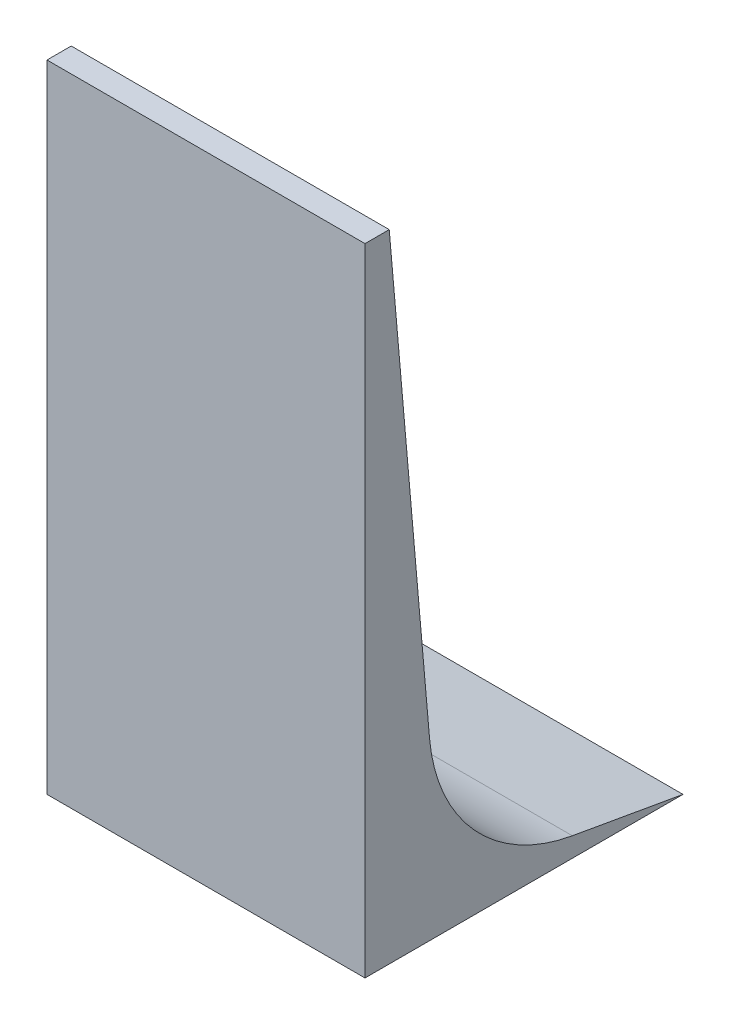
ISO-10303-21;
HEADER;
FILE_DESCRIPTION(('STEP AP214'),'2;1');
FILE_NAME('part.step','',(''),(''),'','','');
FILE_SCHEMA(('AUTOMOTIVE_DESIGN { 1 0 10303 214 1 1 1 1 }'));
ENDSEC;
DATA;
#1=APPLICATION_CONTEXT('core data for automotive mechanical design processes');
#2=APPLICATION_PROTOCOL_DEFINITION('international standard','automotive_design',2000,#1);
#3=PRODUCT_CONTEXT('',#1,'mechanical');
#4=PRODUCT('Part','Part','',(#3));
#5=PRODUCT_RELATED_PRODUCT_CATEGORY('part','',(#4));
#6=PRODUCT_DEFINITION_FORMATION('','',#4);
#7=PRODUCT_DEFINITION_CONTEXT('part definition',#1,'design');
#8=PRODUCT_DEFINITION('design','',#6,#7);
#9=PRODUCT_DEFINITION_SHAPE('','',#8);
#10=(LENGTH_UNIT() NAMED_UNIT(*) SI_UNIT(.MILLI.,.METRE.));
#11=(NAMED_UNIT(*) PLANE_ANGLE_UNIT() SI_UNIT($,.RADIAN.));
#12=(NAMED_UNIT(*) SI_UNIT($,.STERADIAN.) SOLID_ANGLE_UNIT());
#13=UNCERTAINTY_MEASURE_WITH_UNIT(LENGTH_MEASURE(1.E-05),#10,'distance_accuracy_value','');
#14=(GEOMETRIC_REPRESENTATION_CONTEXT(3) GLOBAL_UNCERTAINTY_ASSIGNED_CONTEXT((#13)) GLOBAL_UNIT_ASSIGNED_CONTEXT((#10,
#11,#12)) REPRESENTATION_CONTEXT('',''));
#15=CARTESIAN_POINT('',(0.,0.,0.));
#16=DIRECTION('',(0.,0.,1.));
#17=DIRECTION('',(1.,0.,0.));
#18=AXIS2_PLACEMENT_3D('',#15,#16,#17);
#19=CARTESIAN_POINT('',(-500.,0.,0.));
#20=DIRECTION('',(0.,0.,1.));
#21=DIRECTION('',(1.,0.,0.));
#22=AXIS2_PLACEMENT_3D('',#19,#20,#21);
#23=PLANE('',#22);
#24=DIRECTION('',(0.,-1.,0.));
#25=VECTOR('',#24,1.);
#26=CARTESIAN_POINT('',(0.,0.,0.));
#27=LINE('',#26,#25);
#28=CARTESIAN_POINT('',(0.,1000.,0.));
#29=VERTEX_POINT('',#28);
#30=CARTESIAN_POINT('',(0.,0.,0.));
#31=VERTEX_POINT('',#30);
#32=EDGE_CURVE('E130',#29,#31,#27,.T.);
#33=ORIENTED_EDGE('',*,*,#32,.F.);
#34=DIRECTION('',(1.,0.,0.));
#35=VECTOR('',#34,1.);
#36=CARTESIAN_POINT('',(-500.,1000.,0.));
#37=LINE('',#36,#35);
#38=CARTESIAN_POINT('',(-500.,1000.,0.));
#39=VERTEX_POINT('',#38);
#40=EDGE_CURVE('E11',#39,#29,#37,.T.);
#41=ORIENTED_EDGE('',*,*,#40,.F.);
#42=DIRECTION('',(0.,-1.,0.));
#43=VECTOR('',#42,1.);
#44=CARTESIAN_POINT('',(-500.,0.,0.));
#45=LINE('',#44,#43);
#46=CARTESIAN_POINT('',(-500.,0.,0.));
#47=VERTEX_POINT('',#46);
#48=EDGE_CURVE('E150',#39,#47,#45,.T.);
#49=ORIENTED_EDGE('',*,*,#48,.T.);
#50=DIRECTION('',(1.,0.,0.));
#51=VECTOR('',#50,1.);
#52=CARTESIAN_POINT('',(-500.,0.,0.));
#53=LINE('',#52,#51);
#54=EDGE_CURVE('E42',#47,#31,#53,.T.);
#55=ORIENTED_EDGE('',*,*,#54,.T.);
#56=EDGE_LOOP('',(#33,#41,#49,#55));
#57=FACE_BOUND('',#56,.T.);
#58=ADVANCED_FACE('F39',(#57),#23,.T.);
#59=CARTESIAN_POINT('',(-500.,1000.,0.));
#60=DIRECTION('',(0.,1.,0.));
#61=DIRECTION('',(0.,0.,1.));
#62=AXIS2_PLACEMENT_3D('',#59,#60,#61);
#63=PLANE('',#62);
#64=DIRECTION('',(0.,0.,1.));
#65=VECTOR('',#64,1.);
#66=CARTESIAN_POINT('',(0.,1000.,0.));
#67=LINE('',#66,#65);
#68=CARTESIAN_POINT('',(0.,1000.,-38.1));
#69=VERTEX_POINT('',#68);
#70=EDGE_CURVE('E147',#69,#29,#67,.T.);
#71=ORIENTED_EDGE('',*,*,#70,.F.);
#72=DIRECTION('',(1.,0.,0.));
#73=VECTOR('',#72,1.);
#74=CARTESIAN_POINT('',(-500.,1000.,-38.1));
#75=LINE('',#74,#73);
#76=CARTESIAN_POINT('',(-500.,1000.,-38.1));
#77=VERTEX_POINT('',#76);
#78=EDGE_CURVE('E49',#77,#69,#75,.T.);
#79=ORIENTED_EDGE('',*,*,#78,.F.);
#80=DIRECTION('',(0.,0.,1.));
#81=VECTOR('',#80,1.);
#82=CARTESIAN_POINT('',(-500.,1000.,0.));
#83=LINE('',#82,#81);
#84=EDGE_CURVE('E116',#77,#39,#83,.T.);
#85=ORIENTED_EDGE('',*,*,#84,.T.);
#86=ORIENTED_EDGE('',*,*,#40,.T.);
#87=EDGE_LOOP('',(#71,#79,#85,#86));
#88=FACE_BOUND('',#87,.T.);
#89=ADVANCED_FACE('F162',(#88),#63,.T.);
#90=CARTESIAN_POINT('',(-500.,1000.,-38.1));
#91=DIRECTION('',(0.,0.087155742747655,-0.996194698091746));
#92=DIRECTION('',(0.,0.996194698091746,0.087155742747655));
#93=AXIS2_PLACEMENT_3D('',#90,#91,#92);
#94=PLANE('',#93);
#95=DIRECTION('',(0.,0.996194698091746,0.087155742747655));
#96=VECTOR('',#95,1.);
#97=CARTESIAN_POINT('',(0.,1000.,-38.1));
#98=LINE('',#97,#96);
#99=CARTESIAN_POINT('',(0.,275.710444690666,-101.467125199797));
#100=VERTEX_POINT('',#99);
#101=EDGE_CURVE('E102',#100,#69,#98,.T.);
#102=ORIENTED_EDGE('',*,*,#101,.F.);
#103=DIRECTION('',(1.,0.,0.));
#104=VECTOR('',#103,1.);
#105=CARTESIAN_POINT('',(-500.,275.710444690666,-101.467125199797));
#106=LINE('',#105,#104);
#107=CARTESIAN_POINT('',(-500.,275.710444690666,-101.467125199797));
#108=VERTEX_POINT('',#107);
#109=EDGE_CURVE('E97',#108,#100,#106,.T.);
#110=ORIENTED_EDGE('',*,*,#109,.F.);
#111=DIRECTION('',(0.,0.996194698091746,0.087155742747655));
#112=VECTOR('',#111,1.);
#113=CARTESIAN_POINT('',(-500.,1000.,-38.1));
#114=LINE('',#113,#112);
#115=EDGE_CURVE('E100',#108,#77,#114,.T.);
#116=ORIENTED_EDGE('',*,*,#115,.T.);
#117=ORIENTED_EDGE('',*,*,#78,.T.);
#118=EDGE_LOOP('',(#102,#110,#116,#117));
#119=FACE_BOUND('',#118,.T.);
#120=ADVANCED_FACE('F99',(#119),#94,.T.);
#121=CARTESIAN_POINT('',(-500.,299.501008047575,-373.394508681441));
#122=DIRECTION('',(1.,0.,0.));
#123=DIRECTION('',(0.,0.,-1.));
#124=AXIS2_PLACEMENT_3D('',#121,#122,#123);
#125=CYLINDRICAL_SURFACE('',#124,272.966101910131);
#126=CARTESIAN_POINT('',(0.,299.501008047575,-373.394508681441));
#127=DIRECTION('',(-1.,0.,0.));
#128=DIRECTION('',(0.,0.,-1.));
#129=AXIS2_PLACEMENT_3D('',#126,#127,#128);
#130=CIRCLE('',#129,272.966101910131);
#131=CARTESIAN_POINT('',(0.,30.6818745769576,-325.994442519903));
#132=VERTEX_POINT('',#131);
#133=EDGE_CURVE('E142',#132,#100,#130,.T.);
#134=ORIENTED_EDGE('',*,*,#133,.F.);
#135=DIRECTION('',(1.,0.,0.));
#136=VECTOR('',#135,1.);
#137=CARTESIAN_POINT('',(-500.,30.6818745769576,-325.994442519903));
#138=LINE('',#137,#136);
#139=CARTESIAN_POINT('',(-500.,30.6818745769576,-325.994442519903));
#140=VERTEX_POINT('',#139);
#141=EDGE_CURVE('E108',#140,#132,#138,.T.);
#142=ORIENTED_EDGE('',*,*,#141,.F.);
#143=CARTESIAN_POINT('',(-500.,299.501008047575,-373.394508681441));
#144=DIRECTION('',(-1.,0.,0.));
#145=DIRECTION('',(0.,0.,-1.));
#146=AXIS2_PLACEMENT_3D('',#143,#144,#145);
#147=CIRCLE('',#146,272.966101910131);
#148=EDGE_CURVE('E114',#140,#108,#147,.T.);
#149=ORIENTED_EDGE('',*,*,#148,.T.);
#150=ORIENTED_EDGE('',*,*,#109,.T.);
#151=EDGE_LOOP('',(#134,#142,#149,#150));
#152=FACE_BOUND('',#151,.T.);
#153=ADVANCED_FACE('F119',(#152),#125,.F.);
#154=CARTESIAN_POINT('',(-500.,0.,-500.));
#155=DIRECTION('',(0.,0.984807753012209,-0.173648177666924));
#156=DIRECTION('',(0.,0.173648177666924,0.984807753012209));
#157=AXIS2_PLACEMENT_3D('',#154,#155,#156);
#158=PLANE('',#157);
#159=DIRECTION('',(0.,0.173648177666924,0.984807753012209));
#160=VECTOR('',#159,1.);
#161=CARTESIAN_POINT('',(0.,0.,-500.));
#162=LINE('',#161,#160);
#163=CARTESIAN_POINT('',(0.,0.,-500.));
#164=VERTEX_POINT('',#163);
#165=EDGE_CURVE('E138',#164,#132,#162,.T.);
#166=ORIENTED_EDGE('',*,*,#165,.F.);
#167=DIRECTION('',(1.,0.,0.));
#168=VECTOR('',#167,1.);
#169=CARTESIAN_POINT('',(-500.,0.,-500.));
#170=LINE('',#169,#168);
#171=CARTESIAN_POINT('',(-500.,0.,-500.));
#172=VERTEX_POINT('',#171);
#173=EDGE_CURVE('E155',#172,#164,#170,.T.);
#174=ORIENTED_EDGE('',*,*,#173,.F.);
#175=DIRECTION('',(0.,0.173648177666924,0.984807753012209));
#176=VECTOR('',#175,1.);
#177=CARTESIAN_POINT('',(-500.,0.,-500.));
#178=LINE('',#177,#176);
#179=EDGE_CURVE('E121',#172,#140,#178,.T.);
#180=ORIENTED_EDGE('',*,*,#179,.T.);
#181=ORIENTED_EDGE('',*,*,#141,.T.);
#182=EDGE_LOOP('',(#166,#174,#180,#181));
#183=FACE_BOUND('',#182,.T.);
#184=ADVANCED_FACE('F175',(#183),#158,.T.);
#185=CARTESIAN_POINT('',(-500.,0.,0.));
#186=DIRECTION('',(0.,-1.,0.));
#187=DIRECTION('',(0.,0.,-1.));
#188=AXIS2_PLACEMENT_3D('',#185,#186,#187);
#189=PLANE('',#188);
#190=DIRECTION('',(0.,0.,-1.));
#191=VECTOR('',#190,1.);
#192=CARTESIAN_POINT('',(0.,0.,0.));
#193=LINE('',#192,#191);
#194=EDGE_CURVE('E134',#31,#164,#193,.T.);
#195=ORIENTED_EDGE('',*,*,#194,.F.);
#196=ORIENTED_EDGE('',*,*,#54,.F.);
#197=DIRECTION('',(0.,0.,-1.));
#198=VECTOR('',#197,1.);
#199=CARTESIAN_POINT('',(-500.,0.,0.));
#200=LINE('',#199,#198);
#201=EDGE_CURVE('E124',#47,#172,#200,.T.);
#202=ORIENTED_EDGE('',*,*,#201,.T.);
#203=ORIENTED_EDGE('',*,*,#173,.T.);
#204=EDGE_LOOP('',(#195,#196,#202,#203));
#205=FACE_BOUND('',#204,.T.);
#206=ADVANCED_FACE('F159',(#205),#189,.T.);
#207=CARTESIAN_POINT('',(-500.,299.501008047575,-373.394508681441));
#208=DIRECTION('',(1.,0.,0.));
#209=DIRECTION('',(0.,0.,-1.));
#210=AXIS2_PLACEMENT_3D('',#207,#208,#209);
#211=PLANE('',#210);
#212=ORIENTED_EDGE('',*,*,#48,.F.);
#213=ORIENTED_EDGE('',*,*,#84,.F.);
#214=ORIENTED_EDGE('',*,*,#115,.F.);
#215=ORIENTED_EDGE('',*,*,#148,.F.);
#216=ORIENTED_EDGE('',*,*,#179,.F.);
#217=ORIENTED_EDGE('',*,*,#201,.F.);
#218=EDGE_LOOP('',(#212,#213,#214,#215,#216,#217));
#219=FACE_BOUND('',#218,.T.);
#220=ADVANCED_FACE('F112',(#219),#211,.F.);
#221=CARTESIAN_POINT('',(0.,299.501008047575,-373.394508681441));
#222=DIRECTION('',(1.,0.,0.));
#223=DIRECTION('',(0.,0.,-1.));
#224=AXIS2_PLACEMENT_3D('',#221,#222,#223);
#225=PLANE('',#224);
#226=ORIENTED_EDGE('',*,*,#32,.T.);
#227=ORIENTED_EDGE('',*,*,#194,.T.);
#228=ORIENTED_EDGE('',*,*,#165,.T.);
#229=ORIENTED_EDGE('',*,*,#133,.T.);
#230=ORIENTED_EDGE('',*,*,#101,.T.);
#231=ORIENTED_EDGE('',*,*,#70,.T.);
#232=EDGE_LOOP('',(#226,#227,#228,#229,#230,#231));
#233=FACE_BOUND('',#232,.T.);
#234=ADVANCED_FACE('F161',(#233),#225,.T.);
#235=CLOSED_SHELL('',(#58,#89,#120,#153,#184,#206,#220,#234));
#236=MANIFOLD_SOLID_BREP('B2',#235);
#237=ADVANCED_BREP_SHAPE_REPRESENTATION('',(#18,#236),#14);
#238=SHAPE_DEFINITION_REPRESENTATION(#9,#237);
ENDSEC;
END-ISO-10303-21;
